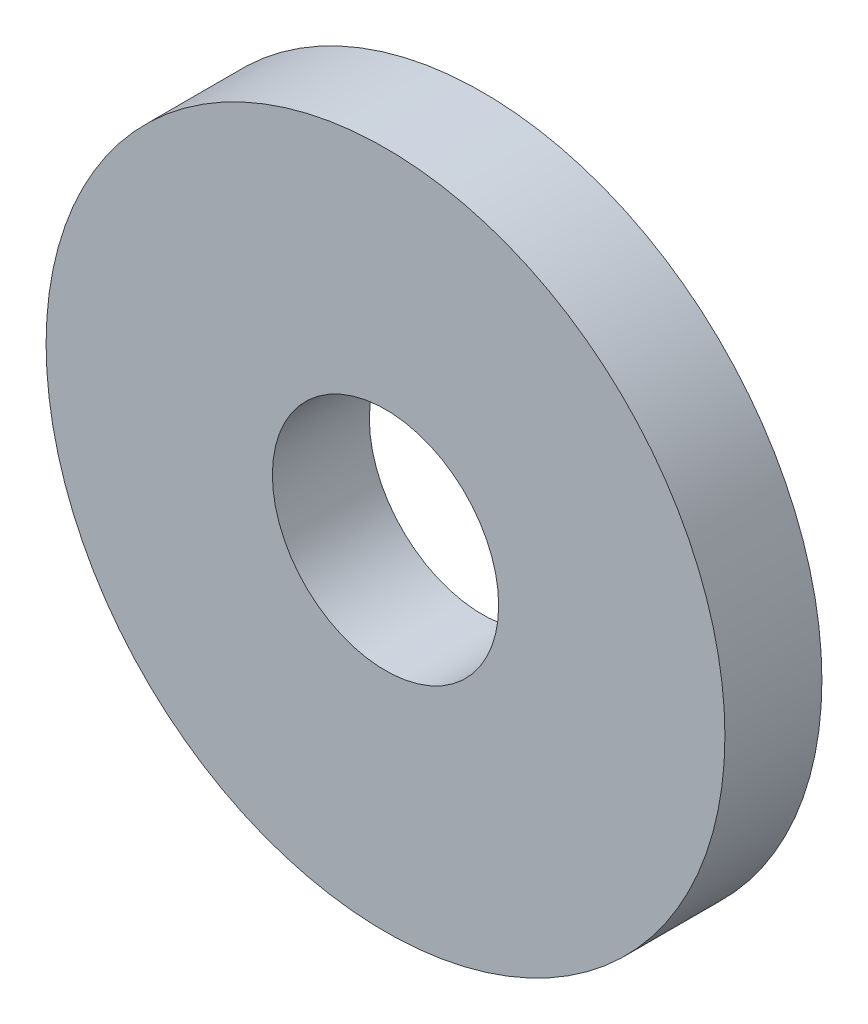
ISO-10303-21;
HEADER;
FILE_DESCRIPTION(('STEP AP214'),'2;1');
FILE_NAME('part.step','',(''),(''),'','','');
FILE_SCHEMA(('AUTOMOTIVE_DESIGN { 1 0 10303 214 1 1 1 1 }'));
ENDSEC;
DATA;
#1=APPLICATION_CONTEXT('core data for automotive mechanical design processes');
#2=APPLICATION_PROTOCOL_DEFINITION('international standard','automotive_design',2000,#1);
#3=PRODUCT_CONTEXT('',#1,'mechanical');
#4=PRODUCT('Part','Part','',(#3));
#5=PRODUCT_RELATED_PRODUCT_CATEGORY('part','',(#4));
#6=PRODUCT_DEFINITION_FORMATION('','',#4);
#7=PRODUCT_DEFINITION_CONTEXT('part definition',#1,'design');
#8=PRODUCT_DEFINITION('design','',#6,#7);
#9=PRODUCT_DEFINITION_SHAPE('','',#8);
#10=(LENGTH_UNIT() NAMED_UNIT(*) SI_UNIT(.MILLI.,.METRE.));
#11=(NAMED_UNIT(*) PLANE_ANGLE_UNIT() SI_UNIT($,.RADIAN.));
#12=(NAMED_UNIT(*) SI_UNIT($,.STERADIAN.) SOLID_ANGLE_UNIT());
#13=UNCERTAINTY_MEASURE_WITH_UNIT(LENGTH_MEASURE(1.E-05),#10,'distance_accuracy_value','');
#14=(GEOMETRIC_REPRESENTATION_CONTEXT(3) GLOBAL_UNCERTAINTY_ASSIGNED_CONTEXT((#13)) GLOBAL_UNIT_ASSIGNED_CONTEXT((#10,
#11,#12)) REPRESENTATION_CONTEXT('',''));
#15=CARTESIAN_POINT('',(0.,0.,0.));
#16=DIRECTION('',(0.,0.,1.));
#17=DIRECTION('',(1.,0.,0.));
#18=AXIS2_PLACEMENT_3D('',#15,#16,#17);
#19=CARTESIAN_POINT('',(0.,0.,19.));
#20=DIRECTION('',(0.,0.,1.));
#21=DIRECTION('',(1.,0.,0.));
#22=AXIS2_PLACEMENT_3D('',#19,#20,#21);
#23=PLANE('',#22);
#24=CARTESIAN_POINT('',(0.,0.,19.));
#25=DIRECTION('',(0.,0.,1.));
#26=DIRECTION('',(1.,0.,0.));
#27=AXIS2_PLACEMENT_3D('',#24,#25,#26);
#28=CIRCLE('',#27,52.5);
#29=CARTESIAN_POINT('',(52.5,0.,19.));
#30=VERTEX_POINT('',#29);
#31=EDGE_CURVE('E10',#30,#30,#28,.T.);
#32=ORIENTED_EDGE('',*,*,#31,.T.);
#33=EDGE_LOOP('',(#32));
#34=FACE_BOUND('',#33,.T.);
#35=CARTESIAN_POINT('',(0.,0.,19.));
#36=DIRECTION('',(0.,0.,1.));
#37=DIRECTION('',(1.,0.,0.));
#38=AXIS2_PLACEMENT_3D('',#35,#36,#37);
#39=CIRCLE('',#38,17.5);
#40=CARTESIAN_POINT('',(17.5,0.,19.));
#41=VERTEX_POINT('',#40);
#42=EDGE_CURVE('E43',#41,#41,#39,.T.);
#43=ORIENTED_EDGE('',*,*,#42,.F.);
#44=EDGE_LOOP('',(#43));
#45=FACE_BOUND('',#44,.T.);
#46=ADVANCED_FACE('F32',(#34,#45),#23,.T.);
#47=CARTESIAN_POINT('',(0.,0.,4.));
#48=DIRECTION('',(0.,0.,1.));
#49=DIRECTION('',(1.,0.,0.));
#50=AXIS2_PLACEMENT_3D('',#47,#48,#49);
#51=PLANE('',#50);
#52=CARTESIAN_POINT('',(0.,0.,4.));
#53=DIRECTION('',(0.,0.,1.));
#54=DIRECTION('',(1.,0.,0.));
#55=AXIS2_PLACEMENT_3D('',#52,#53,#54);
#56=CIRCLE('',#55,52.5);
#57=CARTESIAN_POINT('',(52.5,0.,4.));
#58=VERTEX_POINT('',#57);
#59=EDGE_CURVE('E36',#58,#58,#56,.T.);
#60=ORIENTED_EDGE('',*,*,#59,.F.);
#61=EDGE_LOOP('',(#60));
#62=FACE_BOUND('',#61,.T.);
#63=CARTESIAN_POINT('',(0.,0.,4.));
#64=DIRECTION('',(0.,0.,1.));
#65=DIRECTION('',(1.,0.,0.));
#66=AXIS2_PLACEMENT_3D('',#63,#64,#65);
#67=CIRCLE('',#66,17.5);
#68=CARTESIAN_POINT('',(17.5,0.,4.));
#69=VERTEX_POINT('',#68);
#70=EDGE_CURVE('E45',#69,#69,#67,.T.);
#71=ORIENTED_EDGE('',*,*,#70,.T.);
#72=EDGE_LOOP('',(#71));
#73=FACE_BOUND('',#72,.T.);
#74=ADVANCED_FACE('F55',(#62,#73),#51,.F.);
#75=CARTESIAN_POINT('',(0.,0.,19.));
#76=DIRECTION('',(0.,0.,-1.));
#77=DIRECTION('',(-1.,0.,0.));
#78=AXIS2_PLACEMENT_3D('',#75,#76,#77);
#79=CYLINDRICAL_SURFACE('',#78,52.5);
#80=ORIENTED_EDGE('',*,*,#31,.F.);
#81=EDGE_LOOP('',(#80));
#82=FACE_BOUND('',#81,.T.);
#83=ORIENTED_EDGE('',*,*,#59,.T.);
#84=EDGE_LOOP('',(#83));
#85=FACE_BOUND('',#84,.T.);
#86=ADVANCED_FACE('F34',(#82,#85),#79,.T.);
#87=CARTESIAN_POINT('',(0.,0.,19.));
#88=DIRECTION('',(0.,0.,-1.));
#89=DIRECTION('',(-1.,0.,0.));
#90=AXIS2_PLACEMENT_3D('',#87,#88,#89);
#91=CYLINDRICAL_SURFACE('',#90,17.5);
#92=ORIENTED_EDGE('',*,*,#42,.T.);
#93=EDGE_LOOP('',(#92));
#94=FACE_BOUND('',#93,.T.);
#95=ORIENTED_EDGE('',*,*,#70,.F.);
#96=EDGE_LOOP('',(#95));
#97=FACE_BOUND('',#96,.T.);
#98=ADVANCED_FACE('F51',(#94,#97),#91,.F.);
#99=CLOSED_SHELL('',(#46,#74,#86,#98));
#100=MANIFOLD_SOLID_BREP('B2',#99);
#101=ADVANCED_BREP_SHAPE_REPRESENTATION('',(#18,#100),#14);
#102=SHAPE_DEFINITION_REPRESENTATION(#9,#101);
ENDSEC;
END-ISO-10303-21;
